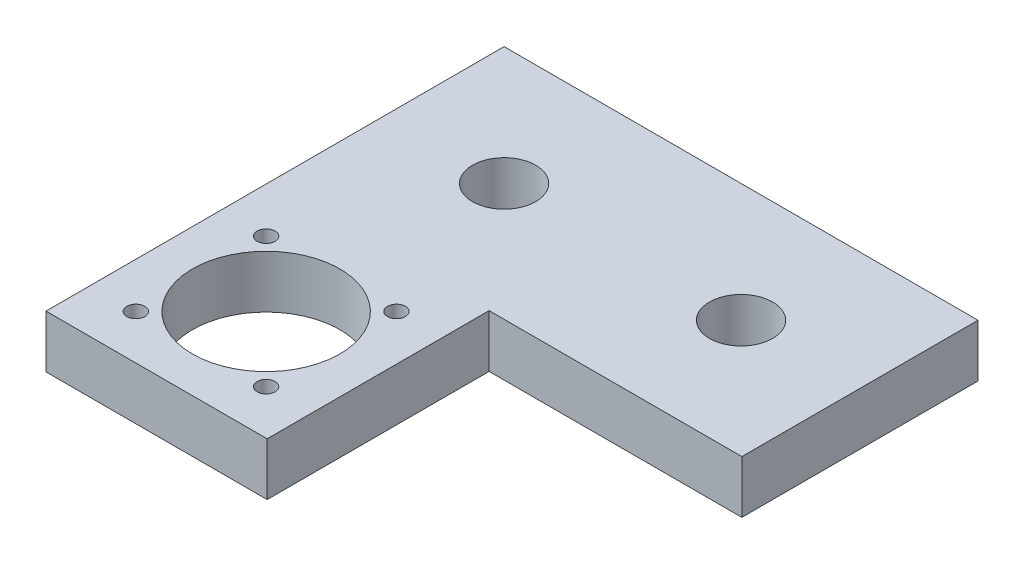
ISO-10303-21;
HEADER;
FILE_DESCRIPTION(('STEP AP214'),'2;1');
FILE_NAME('part.step','',(''),(''),'','','');
FILE_SCHEMA(('AUTOMOTIVE_DESIGN { 1 0 10303 214 1 1 1 1 }'));
ENDSEC;
DATA;
#1=APPLICATION_CONTEXT('core data for automotive mechanical design processes');
#2=APPLICATION_PROTOCOL_DEFINITION('international standard','automotive_design',2000,#1);
#3=PRODUCT_CONTEXT('',#1,'mechanical');
#4=PRODUCT('Part','Part','',(#3));
#5=PRODUCT_RELATED_PRODUCT_CATEGORY('part','',(#4));
#6=PRODUCT_DEFINITION_FORMATION('','',#4);
#7=PRODUCT_DEFINITION_CONTEXT('part definition',#1,'design');
#8=PRODUCT_DEFINITION('design','',#6,#7);
#9=PRODUCT_DEFINITION_SHAPE('','',#8);
#10=(LENGTH_UNIT() NAMED_UNIT(*) SI_UNIT(.MILLI.,.METRE.));
#11=(NAMED_UNIT(*) PLANE_ANGLE_UNIT() SI_UNIT($,.RADIAN.));
#12=(NAMED_UNIT(*) SI_UNIT($,.STERADIAN.) SOLID_ANGLE_UNIT());
#13=UNCERTAINTY_MEASURE_WITH_UNIT(LENGTH_MEASURE(1.E-05),#10,'distance_accuracy_value','');
#14=(GEOMETRIC_REPRESENTATION_CONTEXT(3) GLOBAL_UNCERTAINTY_ASSIGNED_CONTEXT((#13)) GLOBAL_UNIT_ASSIGNED_CONTEXT((#10,
#11,#12)) REPRESENTATION_CONTEXT('',''));
#15=CARTESIAN_POINT('',(0.,0.,0.));
#16=DIRECTION('',(0.,0.,1.));
#17=DIRECTION('',(1.,0.,0.));
#18=AXIS2_PLACEMENT_3D('',#15,#16,#17);
#19=CARTESIAN_POINT('',(0.,10.,42.));
#20=DIRECTION('',(0.,0.,-1.));
#21=DIRECTION('',(-1.,0.,0.));
#22=AXIS2_PLACEMENT_3D('',#19,#20,#21);
#23=PLANE('',#22);
#24=DIRECTION('',(1.,0.,0.));
#25=VECTOR('',#24,1.);
#26=CARTESIAN_POINT('',(0.,0.,42.));
#27=LINE('',#26,#25);
#28=CARTESIAN_POINT('',(0.,0.,42.));
#29=VERTEX_POINT('',#28);
#30=CARTESIAN_POINT('',(42.,0.,42.));
#31=VERTEX_POINT('',#30);
#32=EDGE_CURVE('E123',#29,#31,#27,.T.);
#33=ORIENTED_EDGE('',*,*,#32,.T.);
#34=DIRECTION('',(0.,-1.,0.));
#35=VECTOR('',#34,1.);
#36=CARTESIAN_POINT('',(42.,10.,42.));
#37=LINE('',#36,#35);
#38=CARTESIAN_POINT('',(42.,10.,42.));
#39=VERTEX_POINT('',#38);
#40=EDGE_CURVE('E43',#39,#31,#37,.T.);
#41=ORIENTED_EDGE('',*,*,#40,.F.);
#42=DIRECTION('',(1.,0.,0.));
#43=VECTOR('',#42,1.);
#44=CARTESIAN_POINT('',(0.,10.,42.));
#45=LINE('',#44,#43);
#46=CARTESIAN_POINT('',(0.,10.,42.));
#47=VERTEX_POINT('',#46);
#48=EDGE_CURVE('E89',#47,#39,#45,.T.);
#49=ORIENTED_EDGE('',*,*,#48,.F.);
#50=DIRECTION('',(0.,-1.,0.));
#51=VECTOR('',#50,1.);
#52=CARTESIAN_POINT('',(0.,10.,42.));
#53=LINE('',#52,#51);
#54=EDGE_CURVE('E11',#47,#29,#53,.T.);
#55=ORIENTED_EDGE('',*,*,#54,.T.);
#56=EDGE_LOOP('',(#33,#41,#49,#55));
#57=FACE_BOUND('',#56,.T.);
#58=ADVANCED_FACE('F35',(#57),#23,.F.);
#59=CARTESIAN_POINT('',(42.,10.,-0.149999791667095));
#60=DIRECTION('',(-1.,0.,0.));
#61=DIRECTION('',(0.,0.,1.));
#62=AXIS2_PLACEMENT_3D('',#59,#60,#61);
#63=PLANE('',#62);
#64=DIRECTION('',(0.,0.,-1.));
#65=VECTOR('',#64,1.);
#66=CARTESIAN_POINT('',(42.,0.,-0.149999791667095));
#67=LINE('',#66,#65);
#68=CARTESIAN_POINT('',(42.,0.,-0.149999791667095));
#69=VERTEX_POINT('',#68);
#70=EDGE_CURVE('E125',#31,#69,#67,.T.);
#71=ORIENTED_EDGE('',*,*,#70,.T.);
#72=DIRECTION('',(0.,-1.,0.));
#73=VECTOR('',#72,1.);
#74=CARTESIAN_POINT('',(42.,10.,-0.149999791667095));
#75=LINE('',#74,#73);
#76=CARTESIAN_POINT('',(42.,10.,-0.149999791667095));
#77=VERTEX_POINT('',#76);
#78=EDGE_CURVE('E112',#77,#69,#75,.T.);
#79=ORIENTED_EDGE('',*,*,#78,.F.);
#80=DIRECTION('',(0.,0.,-1.));
#81=VECTOR('',#80,1.);
#82=CARTESIAN_POINT('',(42.,10.,-0.149999791667095));
#83=LINE('',#82,#81);
#84=EDGE_CURVE('E103',#39,#77,#83,.T.);
#85=ORIENTED_EDGE('',*,*,#84,.F.);
#86=ORIENTED_EDGE('',*,*,#40,.T.);
#87=EDGE_LOOP('',(#71,#79,#85,#86));
#88=FACE_BOUND('',#87,.T.);
#89=ADVANCED_FACE('F138',(#88),#63,.F.);
#90=CARTESIAN_POINT('',(42.,10.,-0.149999791667095));
#91=DIRECTION('',(0.,0.,-1.));
#92=DIRECTION('',(-1.,0.,0.));
#93=AXIS2_PLACEMENT_3D('',#90,#91,#92);
#94=PLANE('',#93);
#95=DIRECTION('',(1.,0.,0.));
#96=VECTOR('',#95,1.);
#97=CARTESIAN_POINT('',(42.,0.,-0.149999791667095));
#98=LINE('',#97,#96);
#99=CARTESIAN_POINT('',(89.9998750002604,0.,-0.149999791667095));
#100=VERTEX_POINT('',#99);
#101=EDGE_CURVE('E111',#69,#100,#98,.T.);
#102=ORIENTED_EDGE('',*,*,#101,.T.);
#103=DIRECTION('',(0.,-1.,0.));
#104=VECTOR('',#103,1.);
#105=CARTESIAN_POINT('',(89.9998750002604,10.,-0.149999791667095));
#106=LINE('',#105,#104);
#107=CARTESIAN_POINT('',(89.9998750002604,10.,-0.149999791667095));
#108=VERTEX_POINT('',#107);
#109=EDGE_CURVE('E108',#108,#100,#106,.T.);
#110=ORIENTED_EDGE('',*,*,#109,.F.);
#111=DIRECTION('',(1.,0.,0.));
#112=VECTOR('',#111,1.);
#113=CARTESIAN_POINT('',(42.,10.,-0.149999791667095));
#114=LINE('',#113,#112);
#115=EDGE_CURVE('E97',#77,#108,#114,.T.);
#116=ORIENTED_EDGE('',*,*,#115,.F.);
#117=ORIENTED_EDGE('',*,*,#78,.T.);
#118=EDGE_LOOP('',(#102,#110,#116,#117));
#119=FACE_BOUND('',#118,.T.);
#120=ADVANCED_FACE('F109',(#119),#94,.F.);
#121=CARTESIAN_POINT('',(89.9998750002604,10.,-0.149999791667095));
#122=DIRECTION('',(-1.,0.,0.));
#123=DIRECTION('',(0.,0.,1.));
#124=AXIS2_PLACEMENT_3D('',#121,#122,#123);
#125=PLANE('',#124);
#126=DIRECTION('',(0.,0.,-1.));
#127=VECTOR('',#126,1.);
#128=CARTESIAN_POINT('',(89.9998750002604,0.,-0.149999791667095));
#129=LINE('',#128,#127);
#130=CARTESIAN_POINT('',(89.9998750002604,0.,-45.));
#131=VERTEX_POINT('',#130);
#132=EDGE_CURVE('E75',#100,#131,#129,.T.);
#133=ORIENTED_EDGE('',*,*,#132,.T.);
#134=DIRECTION('',(0.,-1.,0.));
#135=VECTOR('',#134,1.);
#136=CARTESIAN_POINT('',(89.9998750002604,10.,-45.));
#137=LINE('',#136,#135);
#138=CARTESIAN_POINT('',(89.9998750002604,10.,-45.));
#139=VERTEX_POINT('',#138);
#140=EDGE_CURVE('E113',#139,#131,#137,.T.);
#141=ORIENTED_EDGE('',*,*,#140,.F.);
#142=DIRECTION('',(0.,0.,-1.));
#143=VECTOR('',#142,1.);
#144=CARTESIAN_POINT('',(89.9998750002604,10.,-0.149999791667095));
#145=LINE('',#144,#143);
#146=EDGE_CURVE('E101',#108,#139,#145,.T.);
#147=ORIENTED_EDGE('',*,*,#146,.F.);
#148=ORIENTED_EDGE('',*,*,#109,.T.);
#149=EDGE_LOOP('',(#133,#141,#147,#148));
#150=FACE_BOUND('',#149,.T.);
#151=ADVANCED_FACE('F115',(#150),#125,.F.);
#152=CARTESIAN_POINT('',(0.,10.,-45.));
#153=DIRECTION('',(0.,0.,1.));
#154=DIRECTION('',(1.,0.,0.));
#155=AXIS2_PLACEMENT_3D('',#152,#153,#154);
#156=PLANE('',#155);
#157=DIRECTION('',(-1.,0.,0.));
#158=VECTOR('',#157,1.);
#159=CARTESIAN_POINT('',(0.,0.,-45.));
#160=LINE('',#159,#158);
#161=CARTESIAN_POINT('',(0.,0.,-45.));
#162=VERTEX_POINT('',#161);
#163=EDGE_CURVE('E82',#131,#162,#160,.T.);
#164=ORIENTED_EDGE('',*,*,#163,.T.);
#165=DIRECTION('',(0.,-1.,0.));
#166=VECTOR('',#165,1.);
#167=CARTESIAN_POINT('',(0.,10.,-45.));
#168=LINE('',#167,#166);
#169=CARTESIAN_POINT('',(0.,10.,-45.));
#170=VERTEX_POINT('',#169);
#171=EDGE_CURVE('E119',#170,#162,#168,.T.);
#172=ORIENTED_EDGE('',*,*,#171,.F.);
#173=DIRECTION('',(-1.,0.,0.));
#174=VECTOR('',#173,1.);
#175=CARTESIAN_POINT('',(0.,10.,-45.));
#176=LINE('',#175,#174);
#177=EDGE_CURVE('E117',#139,#170,#176,.T.);
#178=ORIENTED_EDGE('',*,*,#177,.F.);
#179=ORIENTED_EDGE('',*,*,#140,.T.);
#180=EDGE_LOOP('',(#164,#172,#178,#179));
#181=FACE_BOUND('',#180,.T.);
#182=ADVANCED_FACE('F144',(#181),#156,.F.);
#183=CARTESIAN_POINT('',(0.,10.,0.));
#184=DIRECTION('',(1.,0.,0.));
#185=DIRECTION('',(0.,0.,-1.));
#186=AXIS2_PLACEMENT_3D('',#183,#184,#185);
#187=PLANE('',#186);
#188=DIRECTION('',(0.,0.,1.));
#189=VECTOR('',#188,1.);
#190=CARTESIAN_POINT('',(0.,0.,0.));
#191=LINE('',#190,#189);
#192=EDGE_CURVE('E131',#162,#29,#191,.T.);
#193=ORIENTED_EDGE('',*,*,#192,.T.);
#194=ORIENTED_EDGE('',*,*,#54,.F.);
#195=DIRECTION('',(0.,0.,1.));
#196=VECTOR('',#195,1.);
#197=CARTESIAN_POINT('',(0.,10.,0.));
#198=LINE('',#197,#196);
#199=EDGE_CURVE('E51',#170,#47,#198,.T.);
#200=ORIENTED_EDGE('',*,*,#199,.F.);
#201=ORIENTED_EDGE('',*,*,#171,.T.);
#202=EDGE_LOOP('',(#193,#194,#200,#201));
#203=FACE_BOUND('',#202,.T.);
#204=ADVANCED_FACE('F143',(#203),#187,.F.);
#205=CARTESIAN_POINT('',(0.,10.,0.));
#206=DIRECTION('',(0.,1.,0.));
#207=DIRECTION('',(0.,0.,1.));
#208=AXIS2_PLACEMENT_3D('',#205,#206,#207);
#209=PLANE('',#208);
#210=CARTESIAN_POINT('',(33.3337629922394,10.,8.77563132923402));
#211=DIRECTION('',(0.,1.,0.));
#212=DIRECTION('',(0.,0.,1.));
#213=AXIS2_PLACEMENT_3D('',#210,#211,#212);
#214=CIRCLE('',#213,1.7);
#215=CARTESIAN_POINT('',(33.3337629922394,10.,10.475631329234));
#216=VERTEX_POINT('',#215);
#217=EDGE_CURVE('E184',#216,#216,#214,.T.);
#218=ORIENTED_EDGE('',*,*,#217,.F.);
#219=EDGE_LOOP('',(#218));
#220=FACE_BOUND('',#219,.T.);
#221=CARTESIAN_POINT('',(8.58502565071017,10.,8.77563132923374));
#222=DIRECTION('',(0.,1.,0.));
#223=DIRECTION('',(0.,0.,1.));
#224=AXIS2_PLACEMENT_3D('',#221,#222,#223);
#225=CIRCLE('',#224,1.7);
#226=CARTESIAN_POINT('',(8.58502565071017,10.,10.4756313292337));
#227=VERTEX_POINT('',#226);
#228=EDGE_CURVE('E178',#227,#227,#225,.T.);
#229=ORIENTED_EDGE('',*,*,#228,.F.);
#230=EDGE_LOOP('',(#229));
#231=FACE_BOUND('',#230,.T.);
#232=CARTESIAN_POINT('',(8.58502565070998,10.,33.524368670763));
#233=DIRECTION('',(0.,1.,0.));
#234=DIRECTION('',(0.,0.,1.));
#235=AXIS2_PLACEMENT_3D('',#232,#233,#234);
#236=CIRCLE('',#235,1.7);
#237=CARTESIAN_POINT('',(8.58502565070998,10.,35.224368670763));
#238=VERTEX_POINT('',#237);
#239=EDGE_CURVE('E172',#238,#238,#236,.T.);
#240=ORIENTED_EDGE('',*,*,#239,.F.);
#241=EDGE_LOOP('',(#240));
#242=FACE_BOUND('',#241,.T.);
#243=CARTESIAN_POINT('',(33.3337629922392,10.,33.5243686707631));
#244=DIRECTION('',(0.,1.,0.));
#245=DIRECTION('',(0.,0.,1.));
#246=AXIS2_PLACEMENT_3D('',#243,#244,#245);
#247=CIRCLE('',#246,1.69999999999999);
#248=CARTESIAN_POINT('',(33.3337629922392,10.,35.224368670763));
#249=VERTEX_POINT('',#248);
#250=EDGE_CURVE('E166',#249,#249,#247,.T.);
#251=ORIENTED_EDGE('',*,*,#250,.F.);
#252=EDGE_LOOP('',(#251));
#253=FACE_BOUND('',#252,.T.);
#254=CARTESIAN_POINT('',(20.9593943214768,10.,21.1500000000032));
#255=DIRECTION('',(0.,1.,0.));
#256=DIRECTION('',(0.,0.,1.));
#257=AXIS2_PLACEMENT_3D('',#254,#255,#256);
#258=CIRCLE('',#257,14.);
#259=CARTESIAN_POINT('',(20.9593943214768,10.,35.1500000000032));
#260=VERTEX_POINT('',#259);
#261=EDGE_CURVE('E160',#260,#260,#258,.T.);
#262=ORIENTED_EDGE('',*,*,#261,.F.);
#263=EDGE_LOOP('',(#262));
#264=FACE_BOUND('',#263,.T.);
#265=CARTESIAN_POINT('',(22.5,10.,-22.5));
#266=DIRECTION('',(0.,1.,0.));
#267=DIRECTION('',(0.,0.,1.));
#268=AXIS2_PLACEMENT_3D('',#265,#266,#267);
#269=CIRCLE('',#268,6.);
#270=CARTESIAN_POINT('',(22.5,10.,-16.5));
#271=VERTEX_POINT('',#270);
#272=EDGE_CURVE('E154',#271,#271,#269,.T.);
#273=ORIENTED_EDGE('',*,*,#272,.F.);
#274=EDGE_LOOP('',(#273));
#275=FACE_BOUND('',#274,.T.);
#276=CARTESIAN_POINT('',(67.5,10.,-22.5));
#277=DIRECTION('',(0.,1.,0.));
#278=DIRECTION('',(0.,0.,1.));
#279=AXIS2_PLACEMENT_3D('',#276,#277,#278);
#280=CIRCLE('',#279,6.);
#281=CARTESIAN_POINT('',(67.5,10.,-16.5));
#282=VERTEX_POINT('',#281);
#283=EDGE_CURVE('E148',#282,#282,#280,.T.);
#284=ORIENTED_EDGE('',*,*,#283,.F.);
#285=EDGE_LOOP('',(#284));
#286=FACE_BOUND('',#285,.T.);
#287=ORIENTED_EDGE('',*,*,#199,.T.);
#288=ORIENTED_EDGE('',*,*,#48,.T.);
#289=ORIENTED_EDGE('',*,*,#84,.T.);
#290=ORIENTED_EDGE('',*,*,#115,.T.);
#291=ORIENTED_EDGE('',*,*,#146,.T.);
#292=ORIENTED_EDGE('',*,*,#177,.T.);
#293=EDGE_LOOP('',(#287,#288,#289,#290,#291,#292));
#294=FACE_BOUND('',#293,.T.);
#295=ADVANCED_FACE('F99',(#220,#231,#242,#253,#264,#275,#286,#294),#209,.T.);
#296=CARTESIAN_POINT('',(0.,0.,0.));
#297=DIRECTION('',(0.,1.,0.));
#298=DIRECTION('',(0.,0.,1.));
#299=AXIS2_PLACEMENT_3D('',#296,#297,#298);
#300=PLANE('',#299);
#301=CARTESIAN_POINT('',(33.3337629922394,0.,8.77563132923402));
#302=DIRECTION('',(0.,1.,0.));
#303=DIRECTION('',(0.,0.,1.));
#304=AXIS2_PLACEMENT_3D('',#301,#302,#303);
#305=CIRCLE('',#304,1.7);
#306=CARTESIAN_POINT('',(33.3337629922394,0.,10.475631329234));
#307=VERTEX_POINT('',#306);
#308=EDGE_CURVE('E181',#307,#307,#305,.T.);
#309=ORIENTED_EDGE('',*,*,#308,.T.);
#310=EDGE_LOOP('',(#309));
#311=FACE_BOUND('',#310,.T.);
#312=CARTESIAN_POINT('',(8.58502565071017,0.,8.77563132923374));
#313=DIRECTION('',(0.,1.,0.));
#314=DIRECTION('',(0.,0.,1.));
#315=AXIS2_PLACEMENT_3D('',#312,#313,#314);
#316=CIRCLE('',#315,1.7);
#317=CARTESIAN_POINT('',(8.58502565071017,0.,10.4756313292337));
#318=VERTEX_POINT('',#317);
#319=EDGE_CURVE('E175',#318,#318,#316,.T.);
#320=ORIENTED_EDGE('',*,*,#319,.T.);
#321=EDGE_LOOP('',(#320));
#322=FACE_BOUND('',#321,.T.);
#323=CARTESIAN_POINT('',(8.58502565070998,0.,33.524368670763));
#324=DIRECTION('',(0.,1.,0.));
#325=DIRECTION('',(0.,0.,1.));
#326=AXIS2_PLACEMENT_3D('',#323,#324,#325);
#327=CIRCLE('',#326,1.7);
#328=CARTESIAN_POINT('',(8.58502565070998,0.,35.224368670763));
#329=VERTEX_POINT('',#328);
#330=EDGE_CURVE('E169',#329,#329,#327,.T.);
#331=ORIENTED_EDGE('',*,*,#330,.T.);
#332=EDGE_LOOP('',(#331));
#333=FACE_BOUND('',#332,.T.);
#334=CARTESIAN_POINT('',(33.3337629922392,0.,33.5243686707631));
#335=DIRECTION('',(0.,1.,0.));
#336=DIRECTION('',(0.,0.,1.));
#337=AXIS2_PLACEMENT_3D('',#334,#335,#336);
#338=CIRCLE('',#337,1.69999999999999);
#339=CARTESIAN_POINT('',(33.3337629922392,0.,35.224368670763));
#340=VERTEX_POINT('',#339);
#341=EDGE_CURVE('E163',#340,#340,#338,.T.);
#342=ORIENTED_EDGE('',*,*,#341,.T.);
#343=EDGE_LOOP('',(#342));
#344=FACE_BOUND('',#343,.T.);
#345=CARTESIAN_POINT('',(20.9593943214768,0.,21.1500000000032));
#346=DIRECTION('',(0.,1.,0.));
#347=DIRECTION('',(0.,0.,1.));
#348=AXIS2_PLACEMENT_3D('',#345,#346,#347);
#349=CIRCLE('',#348,14.);
#350=CARTESIAN_POINT('',(20.9593943214768,0.,35.1500000000032));
#351=VERTEX_POINT('',#350);
#352=EDGE_CURVE('E157',#351,#351,#349,.T.);
#353=ORIENTED_EDGE('',*,*,#352,.T.);
#354=EDGE_LOOP('',(#353));
#355=FACE_BOUND('',#354,.T.);
#356=CARTESIAN_POINT('',(22.5,0.,-22.5));
#357=DIRECTION('',(0.,1.,0.));
#358=DIRECTION('',(0.,0.,1.));
#359=AXIS2_PLACEMENT_3D('',#356,#357,#358);
#360=CIRCLE('',#359,6.);
#361=CARTESIAN_POINT('',(22.5,0.,-16.5));
#362=VERTEX_POINT('',#361);
#363=EDGE_CURVE('E151',#362,#362,#360,.T.);
#364=ORIENTED_EDGE('',*,*,#363,.T.);
#365=EDGE_LOOP('',(#364));
#366=FACE_BOUND('',#365,.T.);
#367=CARTESIAN_POINT('',(67.5,0.,-22.5));
#368=DIRECTION('',(0.,1.,0.));
#369=DIRECTION('',(0.,0.,1.));
#370=AXIS2_PLACEMENT_3D('',#367,#368,#369);
#371=CIRCLE('',#370,6.);
#372=CARTESIAN_POINT('',(67.5,0.,-16.5));
#373=VERTEX_POINT('',#372);
#374=EDGE_CURVE('E126',#373,#373,#371,.T.);
#375=ORIENTED_EDGE('',*,*,#374,.T.);
#376=EDGE_LOOP('',(#375));
#377=FACE_BOUND('',#376,.T.);
#378=ORIENTED_EDGE('',*,*,#32,.F.);
#379=ORIENTED_EDGE('',*,*,#192,.F.);
#380=ORIENTED_EDGE('',*,*,#163,.F.);
#381=ORIENTED_EDGE('',*,*,#132,.F.);
#382=ORIENTED_EDGE('',*,*,#101,.F.);
#383=ORIENTED_EDGE('',*,*,#70,.F.);
#384=EDGE_LOOP('',(#378,#379,#380,#381,#382,#383));
#385=FACE_BOUND('',#384,.T.);
#386=ADVANCED_FACE('F141',(#311,#322,#333,#344,#355,#366,#377,#385),#300,.F.);
#387=CARTESIAN_POINT('',(67.5,0.,-22.5));
#388=DIRECTION('',(0.,1.,0.));
#389=DIRECTION('',(0.,0.,1.));
#390=AXIS2_PLACEMENT_3D('',#387,#388,#389);
#391=CYLINDRICAL_SURFACE('',#390,6.);
#392=ORIENTED_EDGE('',*,*,#374,.F.);
#393=EDGE_LOOP('',(#392));
#394=FACE_BOUND('',#393,.T.);
#395=ORIENTED_EDGE('',*,*,#283,.T.);
#396=EDGE_LOOP('',(#395));
#397=FACE_BOUND('',#396,.T.);
#398=ADVANCED_FACE('F214',(#394,#397),#391,.F.);
#399=CARTESIAN_POINT('',(22.5,0.,-22.5));
#400=DIRECTION('',(0.,1.,0.));
#401=DIRECTION('',(0.,0.,1.));
#402=AXIS2_PLACEMENT_3D('',#399,#400,#401);
#403=CYLINDRICAL_SURFACE('',#402,6.);
#404=ORIENTED_EDGE('',*,*,#363,.F.);
#405=EDGE_LOOP('',(#404));
#406=FACE_BOUND('',#405,.T.);
#407=ORIENTED_EDGE('',*,*,#272,.T.);
#408=EDGE_LOOP('',(#407));
#409=FACE_BOUND('',#408,.T.);
#410=ADVANCED_FACE('F216',(#406,#409),#403,.F.);
#411=CARTESIAN_POINT('',(20.9593943214768,0.,21.1500000000032));
#412=DIRECTION('',(0.,1.,0.));
#413=DIRECTION('',(0.,0.,1.));
#414=AXIS2_PLACEMENT_3D('',#411,#412,#413);
#415=CYLINDRICAL_SURFACE('',#414,14.);
#416=ORIENTED_EDGE('',*,*,#352,.F.);
#417=EDGE_LOOP('',(#416));
#418=FACE_BOUND('',#417,.T.);
#419=ORIENTED_EDGE('',*,*,#261,.T.);
#420=EDGE_LOOP('',(#419));
#421=FACE_BOUND('',#420,.T.);
#422=ADVANCED_FACE('F223',(#418,#421),#415,.F.);
#423=CARTESIAN_POINT('',(33.3337629922392,0.,33.5243686707631));
#424=DIRECTION('',(0.,1.,0.));
#425=DIRECTION('',(0.,0.,1.));
#426=AXIS2_PLACEMENT_3D('',#423,#424,#425);
#427=CYLINDRICAL_SURFACE('',#426,1.69999999999999);
#428=ORIENTED_EDGE('',*,*,#341,.F.);
#429=EDGE_LOOP('',(#428));
#430=FACE_BOUND('',#429,.T.);
#431=ORIENTED_EDGE('',*,*,#250,.T.);
#432=EDGE_LOOP('',(#431));
#433=FACE_BOUND('',#432,.T.);
#434=ADVANCED_FACE('F265',(#430,#433),#427,.F.);
#435=CARTESIAN_POINT('',(8.58502565070998,0.,33.524368670763));
#436=DIRECTION('',(0.,1.,0.));
#437=DIRECTION('',(0.,0.,1.));
#438=AXIS2_PLACEMENT_3D('',#435,#436,#437);
#439=CYLINDRICAL_SURFACE('',#438,1.7);
#440=ORIENTED_EDGE('',*,*,#330,.F.);
#441=EDGE_LOOP('',(#440));
#442=FACE_BOUND('',#441,.T.);
#443=ORIENTED_EDGE('',*,*,#239,.T.);
#444=EDGE_LOOP('',(#443));
#445=FACE_BOUND('',#444,.T.);
#446=ADVANCED_FACE('F276',(#442,#445),#439,.F.);
#447=CARTESIAN_POINT('',(8.58502565071017,0.,8.77563132923374));
#448=DIRECTION('',(0.,1.,0.));
#449=DIRECTION('',(0.,0.,1.));
#450=AXIS2_PLACEMENT_3D('',#447,#448,#449);
#451=CYLINDRICAL_SURFACE('',#450,1.7);
#452=ORIENTED_EDGE('',*,*,#319,.F.);
#453=EDGE_LOOP('',(#452));
#454=FACE_BOUND('',#453,.T.);
#455=ORIENTED_EDGE('',*,*,#228,.T.);
#456=EDGE_LOOP('',(#455));
#457=FACE_BOUND('',#456,.T.);
#458=ADVANCED_FACE('F195',(#454,#457),#451,.F.);
#459=CARTESIAN_POINT('',(33.3337629922394,0.,8.77563132923402));
#460=DIRECTION('',(0.,1.,0.));
#461=DIRECTION('',(0.,0.,1.));
#462=AXIS2_PLACEMENT_3D('',#459,#460,#461);
#463=CYLINDRICAL_SURFACE('',#462,1.7);
#464=ORIENTED_EDGE('',*,*,#308,.F.);
#465=EDGE_LOOP('',(#464));
#466=FACE_BOUND('',#465,.T.);
#467=ORIENTED_EDGE('',*,*,#217,.T.);
#468=EDGE_LOOP('',(#467));
#469=FACE_BOUND('',#468,.T.);
#470=ADVANCED_FACE('F192',(#466,#469),#463,.F.);
#471=CLOSED_SHELL('',(#58,#89,#120,#151,#182,#204,#295,#386,#398,#410,#422,#434,#446,#458,#470));
#472=MANIFOLD_SOLID_BREP('B2',#471);
#473=ADVANCED_BREP_SHAPE_REPRESENTATION('',(#18,#472),#14);
#474=SHAPE_DEFINITION_REPRESENTATION(#9,#473);
ENDSEC;
END-ISO-10303-21;
